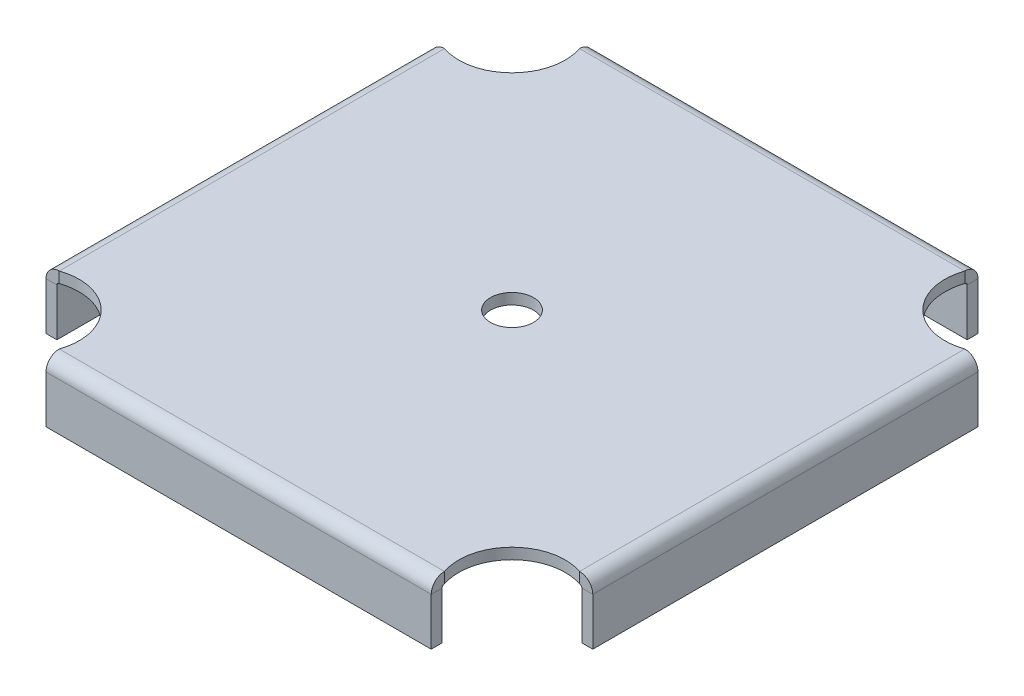
ISO-10303-21;
HEADER;
FILE_DESCRIPTION(('STEP AP214'),'2;1');
FILE_NAME('part.step','',(''),(''),'','','');
FILE_SCHEMA(('AUTOMOTIVE_DESIGN { 1 0 10303 214 1 1 1 1 }'));
ENDSEC;
DATA;
#1=APPLICATION_CONTEXT('core data for automotive mechanical design processes');
#2=APPLICATION_PROTOCOL_DEFINITION('international standard','automotive_design',2000,#1);
#3=PRODUCT_CONTEXT('',#1,'mechanical');
#4=PRODUCT('Part','Part','',(#3));
#5=PRODUCT_RELATED_PRODUCT_CATEGORY('part','',(#4));
#6=PRODUCT_DEFINITION_FORMATION('','',#4);
#7=PRODUCT_DEFINITION_CONTEXT('part definition',#1,'design');
#8=PRODUCT_DEFINITION('design','',#6,#7);
#9=PRODUCT_DEFINITION_SHAPE('','',#8);
#10=(LENGTH_UNIT() NAMED_UNIT(*) SI_UNIT(.MILLI.,.METRE.));
#11=(NAMED_UNIT(*) PLANE_ANGLE_UNIT() SI_UNIT($,.RADIAN.));
#12=(NAMED_UNIT(*) SI_UNIT($,.STERADIAN.) SOLID_ANGLE_UNIT());
#13=UNCERTAINTY_MEASURE_WITH_UNIT(LENGTH_MEASURE(1.E-05),#10,'distance_accuracy_value','');
#14=(GEOMETRIC_REPRESENTATION_CONTEXT(3) GLOBAL_UNCERTAINTY_ASSIGNED_CONTEXT((#13)) GLOBAL_UNIT_ASSIGNED_CONTEXT((#10,
#11,#12)) REPRESENTATION_CONTEXT('',''));
#15=CARTESIAN_POINT('',(0.,0.,0.));
#16=DIRECTION('',(0.,0.,1.));
#17=DIRECTION('',(1.,0.,0.));
#18=AXIS2_PLACEMENT_3D('',#15,#16,#17);
#19=CARTESIAN_POINT('',(76.2,-3.4163,76.2));
#20=DIRECTION('',(0.,1.,0.));
#21=DIRECTION('',(0.,0.,1.));
#22=AXIS2_PLACEMENT_3D('',#19,#20,#21);
#23=CYLINDRICAL_SURFACE('',#22,16.7005);
#24=CARTESIAN_POINT('',(76.2,0.,76.2));
#25=DIRECTION('',(0.,-1.,0.));
#26=DIRECTION('',(0.,0.,1.));
#27=AXIS2_PLACEMENT_3D('',#24,#25,#26);
#28=CIRCLE('',#27,16.7005);
#29=CARTESIAN_POINT('',(60.3828089759907,0.,81.5594));
#30=VERTEX_POINT('',#29);
#31=CARTESIAN_POINT('',(81.5594,0.,60.3828089759907));
#32=VERTEX_POINT('',#31);
#33=EDGE_CURVE('E467',#30,#32,#28,.T.);
#34=ORIENTED_EDGE('',*,*,#33,.F.);
#35=DIRECTION('',(0.,1.,0.));
#36=VECTOR('',#35,1.);
#37=CARTESIAN_POINT('',(60.3828089759907,-3.4163,81.5594));
#38=LINE('',#37,#36);
#39=CARTESIAN_POINT('',(60.3828089759907,-3.4163,81.5594));
#40=VERTEX_POINT('',#39);
#41=EDGE_CURVE('E13',#40,#30,#38,.T.);
#42=ORIENTED_EDGE('',*,*,#41,.F.);
#43=CARTESIAN_POINT('',(76.2,-3.4163,76.2));
#44=DIRECTION('',(0.,-1.,0.));
#45=DIRECTION('',(0.,0.,1.));
#46=AXIS2_PLACEMENT_3D('',#43,#44,#45);
#47=CIRCLE('',#46,16.7005);
#48=CARTESIAN_POINT('',(81.5594,-3.4163,60.3828089759907));
#49=VERTEX_POINT('',#48);
#50=EDGE_CURVE('E470',#40,#49,#47,.T.);
#51=ORIENTED_EDGE('',*,*,#50,.T.);
#52=DIRECTION('',(0.,1.,0.));
#53=VECTOR('',#52,1.);
#54=CARTESIAN_POINT('',(81.5594,-3.4163,60.3828089759907));
#55=LINE('',#54,#53);
#56=EDGE_CURVE('E124',#49,#32,#55,.T.);
#57=ORIENTED_EDGE('',*,*,#56,.T.);
#58=EDGE_LOOP('',(#34,#42,#51,#57));
#59=FACE_BOUND('',#58,.T.);
#60=ADVANCED_FACE('F121',(#59),#23,.F.);
#61=CARTESIAN_POINT('',(-76.2,-3.4163,76.2));
#62=DIRECTION('',(0.,1.,0.));
#63=DIRECTION('',(0.,0.,1.));
#64=AXIS2_PLACEMENT_3D('',#61,#62,#63);
#65=CYLINDRICAL_SURFACE('',#64,16.7005);
#66=CARTESIAN_POINT('',(-76.2,0.,76.2));
#67=DIRECTION('',(0.,-1.,0.));
#68=DIRECTION('',(0.,0.,1.));
#69=AXIS2_PLACEMENT_3D('',#66,#67,#68);
#70=CIRCLE('',#69,16.7005);
#71=CARTESIAN_POINT('',(-81.5594,0.,60.3828089759907));
#72=VERTEX_POINT('',#71);
#73=CARTESIAN_POINT('',(-60.3828089759907,0.,81.5594));
#74=VERTEX_POINT('',#73);
#75=EDGE_CURVE('E508',#72,#74,#70,.T.);
#76=ORIENTED_EDGE('',*,*,#75,.F.);
#77=DIRECTION('',(0.,1.,0.));
#78=VECTOR('',#77,1.);
#79=CARTESIAN_POINT('',(-81.5594,-3.4163,60.3828089759907));
#80=LINE('',#79,#78);
#81=CARTESIAN_POINT('',(-81.5594,-3.4163,60.3828089759907));
#82=VERTEX_POINT('',#81);
#83=EDGE_CURVE('E515',#82,#72,#80,.T.);
#84=ORIENTED_EDGE('',*,*,#83,.F.);
#85=CARTESIAN_POINT('',(-76.2,-3.4163,76.2));
#86=DIRECTION('',(0.,-1.,0.));
#87=DIRECTION('',(0.,0.,1.));
#88=AXIS2_PLACEMENT_3D('',#85,#86,#87);
#89=CIRCLE('',#88,16.7005);
#90=CARTESIAN_POINT('',(-60.3828089759907,-3.4163,81.5594));
#91=VERTEX_POINT('',#90);
#92=EDGE_CURVE('E486',#82,#91,#89,.T.);
#93=ORIENTED_EDGE('',*,*,#92,.T.);
#94=DIRECTION('',(0.,1.,0.));
#95=VECTOR('',#94,1.);
#96=CARTESIAN_POINT('',(-60.3828089759907,-3.4163,81.5594));
#97=LINE('',#96,#95);
#98=EDGE_CURVE('E129',#91,#74,#97,.T.);
#99=ORIENTED_EDGE('',*,*,#98,.T.);
#100=EDGE_LOOP('',(#76,#84,#93,#99));
#101=FACE_BOUND('',#100,.T.);
#102=ADVANCED_FACE('F547',(#101),#65,.F.);
#103=CARTESIAN_POINT('',(-76.2,-3.4163,-76.2));
#104=DIRECTION('',(0.,1.,0.));
#105=DIRECTION('',(0.,0.,1.));
#106=AXIS2_PLACEMENT_3D('',#103,#104,#105);
#107=CYLINDRICAL_SURFACE('',#106,16.7005);
#108=CARTESIAN_POINT('',(-76.2,0.,-76.2));
#109=DIRECTION('',(0.,-1.,0.));
#110=DIRECTION('',(0.,0.,1.));
#111=AXIS2_PLACEMENT_3D('',#108,#109,#110);
#112=CIRCLE('',#111,16.7005);
#113=CARTESIAN_POINT('',(-60.3828089759907,0.,-81.5594));
#114=VERTEX_POINT('',#113);
#115=CARTESIAN_POINT('',(-81.5594,0.,-60.3828089759907));
#116=VERTEX_POINT('',#115);
#117=EDGE_CURVE('E502',#114,#116,#112,.T.);
#118=ORIENTED_EDGE('',*,*,#117,.F.);
#119=DIRECTION('',(0.,1.,0.));
#120=VECTOR('',#119,1.);
#121=CARTESIAN_POINT('',(-60.3828089759907,-3.4163,-81.5594));
#122=LINE('',#121,#120);
#123=CARTESIAN_POINT('',(-60.3828089759907,-3.41630000000001,-81.5594));
#124=VERTEX_POINT('',#123);
#125=EDGE_CURVE('E520',#124,#114,#122,.T.);
#126=ORIENTED_EDGE('',*,*,#125,.F.);
#127=CARTESIAN_POINT('',(-76.2,-3.4163,-76.2));
#128=DIRECTION('',(0.,-1.,0.));
#129=DIRECTION('',(0.,0.,1.));
#130=AXIS2_PLACEMENT_3D('',#127,#128,#129);
#131=CIRCLE('',#130,16.7005);
#132=CARTESIAN_POINT('',(-81.5594,-3.4163,-60.3828089759907));
#133=VERTEX_POINT('',#132);
#134=EDGE_CURVE('E481',#124,#133,#131,.T.);
#135=ORIENTED_EDGE('',*,*,#134,.T.);
#136=DIRECTION('',(0.,1.,0.));
#137=VECTOR('',#136,1.);
#138=CARTESIAN_POINT('',(-81.5594,-3.4163,-60.3828089759907));
#139=LINE('',#138,#137);
#140=EDGE_CURVE('E517',#133,#116,#139,.T.);
#141=ORIENTED_EDGE('',*,*,#140,.T.);
#142=EDGE_LOOP('',(#118,#126,#135,#141));
#143=FACE_BOUND('',#142,.T.);
#144=ADVANCED_FACE('F593',(#143),#107,.F.);
#145=CARTESIAN_POINT('',(76.2,-3.4163,-76.2));
#146=DIRECTION('',(0.,1.,0.));
#147=DIRECTION('',(0.,0.,1.));
#148=AXIS2_PLACEMENT_3D('',#145,#146,#147);
#149=CYLINDRICAL_SURFACE('',#148,16.7005);
#150=CARTESIAN_POINT('',(76.2,0.,-76.2));
#151=DIRECTION('',(0.,-1.,0.));
#152=DIRECTION('',(0.,0.,1.));
#153=AXIS2_PLACEMENT_3D('',#150,#151,#152);
#154=CIRCLE('',#153,16.7005);
#155=CARTESIAN_POINT('',(81.5594,0.,-60.3828089759907));
#156=VERTEX_POINT('',#155);
#157=CARTESIAN_POINT('',(60.3828089759907,0.,-81.5594));
#158=VERTEX_POINT('',#157);
#159=EDGE_CURVE('E496',#156,#158,#154,.T.);
#160=ORIENTED_EDGE('',*,*,#159,.F.);
#161=DIRECTION('',(0.,1.,0.));
#162=VECTOR('',#161,1.);
#163=CARTESIAN_POINT('',(81.5594,-3.4163,-60.3828089759907));
#164=LINE('',#163,#162);
#165=CARTESIAN_POINT('',(81.5594,-3.4163,-60.3828089759907));
#166=VERTEX_POINT('',#165);
#167=EDGE_CURVE('E525',#166,#156,#164,.T.);
#168=ORIENTED_EDGE('',*,*,#167,.F.);
#169=CARTESIAN_POINT('',(76.2,-3.4163,-76.2));
#170=DIRECTION('',(0.,-1.,0.));
#171=DIRECTION('',(0.,0.,1.));
#172=AXIS2_PLACEMENT_3D('',#169,#170,#171);
#173=CIRCLE('',#172,16.7005);
#174=CARTESIAN_POINT('',(60.3828089759907,-3.41630000000001,-81.5594));
#175=VERTEX_POINT('',#174);
#176=EDGE_CURVE('E476',#166,#175,#173,.T.);
#177=ORIENTED_EDGE('',*,*,#176,.T.);
#178=DIRECTION('',(0.,1.,0.));
#179=VECTOR('',#178,1.);
#180=CARTESIAN_POINT('',(60.3828089759907,-3.4163,-81.5594));
#181=LINE('',#180,#179);
#182=EDGE_CURVE('E523',#175,#158,#181,.T.);
#183=ORIENTED_EDGE('',*,*,#182,.T.);
#184=EDGE_LOOP('',(#160,#168,#177,#183));
#185=FACE_BOUND('',#184,.T.);
#186=ADVANCED_FACE('F598',(#185),#149,.F.);
#187=CARTESIAN_POINT('',(76.2,-3.4163,76.2));
#188=DIRECTION('',(0.,1.,0.));
#189=DIRECTION('',(0.,0.,1.));
#190=AXIS2_PLACEMENT_3D('',#187,#188,#189);
#191=PLANE('',#190);
#192=CARTESIAN_POINT('',(0.,-3.4163,0.));
#193=DIRECTION('',(0.,1.,0.));
#194=DIRECTION('',(0.,0.,1.));
#195=AXIS2_PLACEMENT_3D('',#192,#193,#194);
#196=CIRCLE('',#195,6.7437);
#197=CARTESIAN_POINT('',(0.,-3.4163,6.7437));
#198=VERTEX_POINT('',#197);
#199=EDGE_CURVE('E464',#198,#198,#196,.T.);
#200=ORIENTED_EDGE('',*,*,#199,.T.);
#201=EDGE_LOOP('',(#200));
#202=FACE_BOUND('',#201,.T.);
#203=ORIENTED_EDGE('',*,*,#50,.F.);
#204=DIRECTION('',(1.,0.,0.));
#205=VECTOR('',#204,1.);
#206=CARTESIAN_POINT('',(60.3828089759907,-3.4163,81.5594));
#207=LINE('',#206,#205);
#208=EDGE_CURVE('E489',#91,#40,#207,.T.);
#209=ORIENTED_EDGE('',*,*,#208,.F.);
#210=ORIENTED_EDGE('',*,*,#92,.F.);
#211=DIRECTION('',(0.,0.,1.));
#212=VECTOR('',#211,1.);
#213=CARTESIAN_POINT('',(-81.5594,-3.4163,60.3828089759907));
#214=LINE('',#213,#212);
#215=EDGE_CURVE('E484',#133,#82,#214,.T.);
#216=ORIENTED_EDGE('',*,*,#215,.F.);
#217=ORIENTED_EDGE('',*,*,#134,.F.);
#218=DIRECTION('',(-1.,0.,0.));
#219=VECTOR('',#218,1.);
#220=CARTESIAN_POINT('',(-60.3828089759907,-3.4163,-81.5594));
#221=LINE('',#220,#219);
#222=EDGE_CURVE('E479',#175,#124,#221,.T.);
#223=ORIENTED_EDGE('',*,*,#222,.F.);
#224=ORIENTED_EDGE('',*,*,#176,.F.);
#225=DIRECTION('',(0.,0.,-1.));
#226=VECTOR('',#225,1.);
#227=CARTESIAN_POINT('',(81.5594,-3.4163,-60.3828089759907));
#228=LINE('',#227,#226);
#229=EDGE_CURVE('E473',#49,#166,#228,.T.);
#230=ORIENTED_EDGE('',*,*,#229,.F.);
#231=EDGE_LOOP('',(#203,#209,#210,#216,#217,#223,#224,#230));
#232=FACE_BOUND('',#231,.T.);
#233=ADVANCED_FACE('F553',(#202,#232),#191,.F.);
#234=CARTESIAN_POINT('',(76.2,0.,76.2));
#235=DIRECTION('',(0.,1.,0.));
#236=DIRECTION('',(0.,0.,1.));
#237=AXIS2_PLACEMENT_3D('',#234,#235,#236);
#238=PLANE('',#237);
#239=CARTESIAN_POINT('',(0.,0.,0.));
#240=DIRECTION('',(0.,1.,0.));
#241=DIRECTION('',(0.,0.,1.));
#242=AXIS2_PLACEMENT_3D('',#239,#240,#241);
#243=CIRCLE('',#242,6.7437);
#244=CARTESIAN_POINT('',(0.,0.,6.7437));
#245=VERTEX_POINT('',#244);
#246=EDGE_CURVE('E455',#245,#245,#243,.T.);
#247=ORIENTED_EDGE('',*,*,#246,.F.);
#248=EDGE_LOOP('',(#247));
#249=FACE_BOUND('',#248,.T.);
#250=ORIENTED_EDGE('',*,*,#33,.T.);
#251=DIRECTION('',(0.,0.,-1.));
#252=VECTOR('',#251,1.);
#253=CARTESIAN_POINT('',(81.5594,0.,-60.3828089759907));
#254=LINE('',#253,#252);
#255=EDGE_CURVE('E493',#32,#156,#254,.T.);
#256=ORIENTED_EDGE('',*,*,#255,.T.);
#257=ORIENTED_EDGE('',*,*,#159,.T.);
#258=DIRECTION('',(-1.,0.,0.));
#259=VECTOR('',#258,1.);
#260=CARTESIAN_POINT('',(-60.3828089759907,0.,-81.5594));
#261=LINE('',#260,#259);
#262=EDGE_CURVE('E499',#158,#114,#261,.T.);
#263=ORIENTED_EDGE('',*,*,#262,.T.);
#264=ORIENTED_EDGE('',*,*,#117,.T.);
#265=DIRECTION('',(0.,0.,1.));
#266=VECTOR('',#265,1.);
#267=CARTESIAN_POINT('',(-81.5594,0.,60.3828089759907));
#268=LINE('',#267,#266);
#269=EDGE_CURVE('E505',#116,#72,#268,.T.);
#270=ORIENTED_EDGE('',*,*,#269,.T.);
#271=ORIENTED_EDGE('',*,*,#75,.T.);
#272=DIRECTION('',(1.,0.,0.));
#273=VECTOR('',#272,1.);
#274=CARTESIAN_POINT('',(60.3828089759907,0.,81.5594));
#275=LINE('',#274,#273);
#276=EDGE_CURVE('E474',#74,#30,#275,.T.);
#277=ORIENTED_EDGE('',*,*,#276,.T.);
#278=EDGE_LOOP('',(#250,#256,#257,#263,#264,#270,#271,#277));
#279=FACE_BOUND('',#278,.T.);
#280=ADVANCED_FACE('F539',(#249,#279),#238,.T.);
#281=CARTESIAN_POINT('',(0.,-3.4163,0.));
#282=DIRECTION('',(0.,1.,0.));
#283=DIRECTION('',(0.,0.,1.));
#284=AXIS2_PLACEMENT_3D('',#281,#282,#283);
#285=CYLINDRICAL_SURFACE('',#284,6.7437);
#286=ORIENTED_EDGE('',*,*,#199,.F.);
#287=EDGE_LOOP('',(#286));
#288=FACE_BOUND('',#287,.T.);
#289=ORIENTED_EDGE('',*,*,#246,.T.);
#290=EDGE_LOOP('',(#289));
#291=FACE_BOUND('',#290,.T.);
#292=ADVANCED_FACE('F712',(#288,#291),#285,.F.);
#293=CARTESIAN_POINT('',(60.3828089759907,-4.1529,81.5594));
#294=DIRECTION('',(1.,0.,0.));
#295=DIRECTION('',(0.,0.,-1.));
#296=AXIS2_PLACEMENT_3D('',#293,#294,#295);
#297=PLANE('',#296);
#298=DIRECTION('',(0.,0.,1.));
#299=VECTOR('',#298,1.);
#300=CARTESIAN_POINT('',(60.3828089759907,-4.1529,85.7123));
#301=LINE('',#300,#299);
#302=CARTESIAN_POINT('',(60.3828089759907,-4.1529,82.296));
#303=VERTEX_POINT('',#302);
#304=CARTESIAN_POINT('',(60.3828089759907,-4.15289999999999,85.7123));
#305=VERTEX_POINT('',#304);
#306=EDGE_CURVE('E413',#303,#305,#301,.T.);
#307=ORIENTED_EDGE('',*,*,#306,.F.);
#308=CARTESIAN_POINT('',(60.3828089759907,-4.1529,81.5594));
#309=DIRECTION('',(-1.,0.,0.));
#310=DIRECTION('',(0.,0.,1.));
#311=AXIS2_PLACEMENT_3D('',#308,#309,#310);
#312=CIRCLE('',#311,0.736600000000004);
#313=EDGE_CURVE('E459',#40,#303,#312,.F.);
#314=ORIENTED_EDGE('',*,*,#313,.F.);
#315=ORIENTED_EDGE('',*,*,#41,.T.);
#316=CARTESIAN_POINT('',(60.3828089759907,-4.1529,81.5594));
#317=DIRECTION('',(-1.,0.,0.));
#318=DIRECTION('',(0.,0.,1.));
#319=AXIS2_PLACEMENT_3D('',#316,#317,#318);
#320=CIRCLE('',#319,4.1529);
#321=EDGE_CURVE('E137',#30,#305,#320,.F.);
#322=ORIENTED_EDGE('',*,*,#321,.T.);
#323=EDGE_LOOP('',(#307,#314,#315,#322));
#324=FACE_BOUND('',#323,.T.);
#325=ADVANCED_FACE('F560',(#324),#297,.T.);
#326=CARTESIAN_POINT('',(-60.3828089759907,-4.1529,81.5594));
#327=DIRECTION('',(1.,0.,0.));
#328=DIRECTION('',(0.,0.,-1.));
#329=AXIS2_PLACEMENT_3D('',#326,#327,#328);
#330=PLANE('',#329);
#331=CARTESIAN_POINT('',(-60.3828089759907,-4.1529,81.5594));
#332=DIRECTION('',(-1.,0.,0.));
#333=DIRECTION('',(0.,0.,1.));
#334=AXIS2_PLACEMENT_3D('',#331,#332,#333);
#335=CIRCLE('',#334,0.736600000000004);
#336=CARTESIAN_POINT('',(-60.3828089759907,-4.1529,82.296));
#337=VERTEX_POINT('',#336);
#338=EDGE_CURVE('E424',#337,#91,#335,.T.);
#339=ORIENTED_EDGE('',*,*,#338,.F.);
#340=DIRECTION('',(0.,0.,1.));
#341=VECTOR('',#340,1.);
#342=CARTESIAN_POINT('',(-60.3828089759907,-4.1529,82.296));
#343=LINE('',#342,#341);
#344=CARTESIAN_POINT('',(-60.3828089759907,-4.1529,85.7123));
#345=VERTEX_POINT('',#344);
#346=EDGE_CURVE('E447',#337,#345,#343,.T.);
#347=ORIENTED_EDGE('',*,*,#346,.T.);
#348=CARTESIAN_POINT('',(-60.3828089759907,-4.1529,81.5594));
#349=DIRECTION('',(-1.,0.,0.));
#350=DIRECTION('',(0.,0.,1.));
#351=AXIS2_PLACEMENT_3D('',#348,#349,#350);
#352=CIRCLE('',#351,4.1529);
#353=EDGE_CURVE('E456',#345,#74,#352,.T.);
#354=ORIENTED_EDGE('',*,*,#353,.T.);
#355=ORIENTED_EDGE('',*,*,#98,.F.);
#356=EDGE_LOOP('',(#339,#347,#354,#355));
#357=FACE_BOUND('',#356,.T.);
#358=ADVANCED_FACE('F544',(#357),#330,.F.);
#359=CARTESIAN_POINT('',(-60.3828089759907,-4.1529,81.5594));
#360=DIRECTION('',(-1.,0.,0.));
#361=DIRECTION('',(0.,0.,1.));
#362=AXIS2_PLACEMENT_3D('',#359,#360,#361);
#363=CYLINDRICAL_SURFACE('',#362,4.1529);
#364=ORIENTED_EDGE('',*,*,#276,.F.);
#365=ORIENTED_EDGE('',*,*,#353,.F.);
#366=DIRECTION('',(-1.,0.,0.));
#367=VECTOR('',#366,1.);
#368=CARTESIAN_POINT('',(0.,-4.1529,85.7123));
#369=LINE('',#368,#367);
#370=EDGE_CURVE('E444',#305,#345,#369,.T.);
#371=ORIENTED_EDGE('',*,*,#370,.F.);
#372=ORIENTED_EDGE('',*,*,#321,.F.);
#373=EDGE_LOOP('',(#364,#365,#371,#372));
#374=FACE_BOUND('',#373,.T.);
#375=ADVANCED_FACE('F541',(#374),#363,.T.);
#376=CARTESIAN_POINT('',(-60.3828089759907,-4.1529,81.5594));
#377=DIRECTION('',(-1.,0.,0.));
#378=DIRECTION('',(0.,0.,1.));
#379=AXIS2_PLACEMENT_3D('',#376,#377,#378);
#380=CYLINDRICAL_SURFACE('',#379,0.736600000000004);
#381=ORIENTED_EDGE('',*,*,#208,.T.);
#382=ORIENTED_EDGE('',*,*,#313,.T.);
#383=DIRECTION('',(1.,0.,0.));
#384=VECTOR('',#383,1.);
#385=CARTESIAN_POINT('',(60.3828089759907,-4.1529,82.296));
#386=LINE('',#385,#384);
#387=EDGE_CURVE('E450',#303,#337,#386,.F.);
#388=ORIENTED_EDGE('',*,*,#387,.T.);
#389=ORIENTED_EDGE('',*,*,#338,.T.);
#390=EDGE_LOOP('',(#381,#382,#388,#389));
#391=FACE_BOUND('',#390,.T.);
#392=ADVANCED_FACE('F557',(#391),#380,.F.);
#393=CARTESIAN_POINT('',(-60.3828089759907,-3.41629999999999,85.7123));
#394=DIRECTION('',(-1.,0.,0.));
#395=DIRECTION('',(0.,0.,1.));
#396=AXIS2_PLACEMENT_3D('',#393,#394,#395);
#397=PLANE('',#396);
#398=DIRECTION('',(0.,1.,0.));
#399=VECTOR('',#398,1.);
#400=CARTESIAN_POINT('',(-60.3828089759907,-3.41629999999999,85.7123));
#401=LINE('',#400,#399);
#402=CARTESIAN_POINT('',(-60.3828089759907,-19.05,85.7123));
#403=VERTEX_POINT('',#402);
#404=EDGE_CURVE('E428',#403,#345,#401,.T.);
#405=ORIENTED_EDGE('',*,*,#404,.T.);
#406=ORIENTED_EDGE('',*,*,#346,.F.);
#407=DIRECTION('',(0.,-1.,0.));
#408=VECTOR('',#407,1.);
#409=CARTESIAN_POINT('',(-60.3828089759907,2.17196961742773E-13,82.296));
#410=LINE('',#409,#408);
#411=CARTESIAN_POINT('',(-60.3828089759907,-19.05,82.296));
#412=VERTEX_POINT('',#411);
#413=EDGE_CURVE('E436',#412,#337,#410,.F.);
#414=ORIENTED_EDGE('',*,*,#413,.F.);
#415=DIRECTION('',(0.,0.,-1.));
#416=VECTOR('',#415,1.);
#417=CARTESIAN_POINT('',(-60.3828089759907,-19.05,85.7123));
#418=LINE('',#417,#416);
#419=EDGE_CURVE('E422',#403,#412,#418,.T.);
#420=ORIENTED_EDGE('',*,*,#419,.F.);
#421=EDGE_LOOP('',(#405,#406,#414,#420));
#422=FACE_BOUND('',#421,.T.);
#423=ADVANCED_FACE('F577',(#422),#397,.T.);
#424=CARTESIAN_POINT('',(60.3828089759907,-19.05,85.7123));
#425=DIRECTION('',(1.,0.,0.));
#426=DIRECTION('',(0.,0.,-1.));
#427=AXIS2_PLACEMENT_3D('',#424,#425,#426);
#428=PLANE('',#427);
#429=DIRECTION('',(0.,1.,0.));
#430=VECTOR('',#429,1.);
#431=CARTESIAN_POINT('',(60.3828089759907,2.17196961742773E-13,82.296));
#432=LINE('',#431,#430);
#433=CARTESIAN_POINT('',(60.3828089759907,-19.05,82.296));
#434=VERTEX_POINT('',#433);
#435=EDGE_CURVE('E442',#303,#434,#432,.F.);
#436=ORIENTED_EDGE('',*,*,#435,.F.);
#437=ORIENTED_EDGE('',*,*,#306,.T.);
#438=DIRECTION('',(0.,-1.,0.));
#439=VECTOR('',#438,1.);
#440=CARTESIAN_POINT('',(60.3828089759907,-19.05,85.7123));
#441=LINE('',#440,#439);
#442=CARTESIAN_POINT('',(60.3828089759907,-19.05,85.7123));
#443=VERTEX_POINT('',#442);
#444=EDGE_CURVE('E434',#305,#443,#441,.T.);
#445=ORIENTED_EDGE('',*,*,#444,.T.);
#446=DIRECTION('',(0.,0.,-1.));
#447=VECTOR('',#446,1.);
#448=CARTESIAN_POINT('',(60.3828089759907,-19.05,85.7123));
#449=LINE('',#448,#447);
#450=EDGE_CURVE('E425',#443,#434,#449,.T.);
#451=ORIENTED_EDGE('',*,*,#450,.T.);
#452=EDGE_LOOP('',(#436,#437,#445,#451));
#453=FACE_BOUND('',#452,.T.);
#454=ADVANCED_FACE('F564',(#453),#428,.T.);
#455=CARTESIAN_POINT('',(0.,2.29124909440663E-13,85.7123));
#456=DIRECTION('',(0.,0.,1.));
#457=DIRECTION('',(0.,-1.,0.));
#458=AXIS2_PLACEMENT_3D('',#455,#456,#457);
#459=PLANE('',#458);
#460=ORIENTED_EDGE('',*,*,#444,.F.);
#461=ORIENTED_EDGE('',*,*,#370,.T.);
#462=ORIENTED_EDGE('',*,*,#404,.F.);
#463=DIRECTION('',(-1.,0.,0.));
#464=VECTOR('',#463,1.);
#465=CARTESIAN_POINT('',(-60.3828089759907,-19.05,85.7123));
#466=LINE('',#465,#464);
#467=EDGE_CURVE('E431',#443,#403,#466,.T.);
#468=ORIENTED_EDGE('',*,*,#467,.F.);
#469=EDGE_LOOP('',(#460,#461,#462,#468));
#470=FACE_BOUND('',#469,.T.);
#471=ADVANCED_FACE('F568',(#470),#459,.T.);
#472=CARTESIAN_POINT('',(0.,2.17196961742773E-13,82.296));
#473=DIRECTION('',(0.,0.,1.));
#474=DIRECTION('',(0.,-1.,0.));
#475=AXIS2_PLACEMENT_3D('',#472,#473,#474);
#476=PLANE('',#475);
#477=ORIENTED_EDGE('',*,*,#387,.F.);
#478=ORIENTED_EDGE('',*,*,#435,.T.);
#479=DIRECTION('',(1.,0.,0.));
#480=VECTOR('',#479,1.);
#481=CARTESIAN_POINT('',(0.,-19.05,82.296));
#482=LINE('',#481,#480);
#483=EDGE_CURVE('E439',#434,#412,#482,.F.);
#484=ORIENTED_EDGE('',*,*,#483,.T.);
#485=ORIENTED_EDGE('',*,*,#413,.T.);
#486=EDGE_LOOP('',(#477,#478,#484,#485));
#487=FACE_BOUND('',#486,.T.);
#488=ADVANCED_FACE('F575',(#487),#476,.F.);
#489=CARTESIAN_POINT('',(-60.3828089759907,-19.05,85.7123));
#490=DIRECTION('',(0.,-1.,0.));
#491=DIRECTION('',(0.,0.,-1.));
#492=AXIS2_PLACEMENT_3D('',#489,#490,#491);
#493=PLANE('',#492);
#494=ORIENTED_EDGE('',*,*,#483,.F.);
#495=ORIENTED_EDGE('',*,*,#450,.F.);
#496=ORIENTED_EDGE('',*,*,#467,.T.);
#497=ORIENTED_EDGE('',*,*,#419,.T.);
#498=EDGE_LOOP('',(#494,#495,#496,#497));
#499=FACE_BOUND('',#498,.T.);
#500=ADVANCED_FACE('F572',(#499),#493,.T.);
#501=CARTESIAN_POINT('',(81.5594,-4.1529,-60.3828089759907));
#502=DIRECTION('',(0.,0.,-1.));
#503=DIRECTION('',(-1.,0.,0.));
#504=AXIS2_PLACEMENT_3D('',#501,#502,#503);
#505=PLANE('',#504);
#506=DIRECTION('',(1.,0.,0.));
#507=VECTOR('',#506,1.);
#508=CARTESIAN_POINT('',(85.7123,-4.15289999999999,-60.3828089759907));
#509=LINE('',#508,#507);
#510=CARTESIAN_POINT('',(82.296,-4.1529,-60.3828089759907));
#511=VERTEX_POINT('',#510);
#512=CARTESIAN_POINT('',(85.7123,-4.15289999999999,-60.3828089759907));
#513=VERTEX_POINT('',#512);
#514=EDGE_CURVE('E370',#511,#513,#509,.T.);
#515=ORIENTED_EDGE('',*,*,#514,.F.);
#516=CARTESIAN_POINT('',(81.5594,-4.1529,-60.3828089759907));
#517=DIRECTION('',(0.,0.,1.));
#518=DIRECTION('',(1.,0.,0.));
#519=AXIS2_PLACEMENT_3D('',#516,#517,#518);
#520=CIRCLE('',#519,0.736600000000004);
#521=EDGE_CURVE('E417',#166,#511,#520,.F.);
#522=ORIENTED_EDGE('',*,*,#521,.F.);
#523=ORIENTED_EDGE('',*,*,#167,.T.);
#524=CARTESIAN_POINT('',(81.5594,-4.1529,-60.3828089759907));
#525=DIRECTION('',(0.,0.,1.));
#526=DIRECTION('',(1.,0.,0.));
#527=AXIS2_PLACEMENT_3D('',#524,#525,#526);
#528=CIRCLE('',#527,4.1529);
#529=EDGE_CURVE('E410',#156,#513,#528,.F.);
#530=ORIENTED_EDGE('',*,*,#529,.T.);
#531=EDGE_LOOP('',(#515,#522,#523,#530));
#532=FACE_BOUND('',#531,.T.);
#533=ADVANCED_FACE('F695',(#532),#505,.T.);
#534=CARTESIAN_POINT('',(81.5594,-4.1529,60.3828089759907));
#535=DIRECTION('',(0.,0.,-1.));
#536=DIRECTION('',(-1.,0.,0.));
#537=AXIS2_PLACEMENT_3D('',#534,#535,#536);
#538=PLANE('',#537);
#539=CARTESIAN_POINT('',(81.5594,-4.1529,60.3828089759907));
#540=DIRECTION('',(0.,0.,1.));
#541=DIRECTION('',(1.,0.,0.));
#542=AXIS2_PLACEMENT_3D('',#539,#540,#541);
#543=CIRCLE('',#542,0.736600000000004);
#544=CARTESIAN_POINT('',(82.296,-4.1529,60.3828089759907));
#545=VERTEX_POINT('',#544);
#546=EDGE_CURVE('E381',#545,#49,#543,.T.);
#547=ORIENTED_EDGE('',*,*,#546,.F.);
#548=DIRECTION('',(1.,0.,0.));
#549=VECTOR('',#548,1.);
#550=CARTESIAN_POINT('',(82.296,-4.1529,60.3828089759907));
#551=LINE('',#550,#549);
#552=CARTESIAN_POINT('',(85.7123,-4.15289999999999,60.3828089759907));
#553=VERTEX_POINT('',#552);
#554=EDGE_CURVE('E403',#545,#553,#551,.T.);
#555=ORIENTED_EDGE('',*,*,#554,.T.);
#556=CARTESIAN_POINT('',(81.5594,-4.1529,60.3828089759907));
#557=DIRECTION('',(0.,0.,1.));
#558=DIRECTION('',(1.,0.,0.));
#559=AXIS2_PLACEMENT_3D('',#556,#557,#558);
#560=CIRCLE('',#559,4.1529);
#561=EDGE_CURVE('E414',#553,#32,#560,.T.);
#562=ORIENTED_EDGE('',*,*,#561,.T.);
#563=ORIENTED_EDGE('',*,*,#56,.F.);
#564=EDGE_LOOP('',(#547,#555,#562,#563));
#565=FACE_BOUND('',#564,.T.);
#566=ADVANCED_FACE('F690',(#565),#538,.F.);
#567=CARTESIAN_POINT('',(81.5594,-4.1529,60.3828089759907));
#568=DIRECTION('',(0.,0.,1.));
#569=DIRECTION('',(1.,0.,0.));
#570=AXIS2_PLACEMENT_3D('',#567,#568,#569);
#571=CYLINDRICAL_SURFACE('',#570,4.1529);
#572=ORIENTED_EDGE('',*,*,#255,.F.);
#573=ORIENTED_EDGE('',*,*,#561,.F.);
#574=DIRECTION('',(0.,0.,1.));
#575=VECTOR('',#574,1.);
#576=CARTESIAN_POINT('',(85.7123,-4.15289999999999,-60.3828089759907));
#577=LINE('',#576,#575);
#578=EDGE_CURVE('E401',#553,#513,#577,.F.);
#579=ORIENTED_EDGE('',*,*,#578,.T.);
#580=ORIENTED_EDGE('',*,*,#529,.F.);
#581=EDGE_LOOP('',(#572,#573,#579,#580));
#582=FACE_BOUND('',#581,.T.);
#583=ADVANCED_FACE('F687',(#582),#571,.T.);
#584=CARTESIAN_POINT('',(81.5594,-4.1529,60.3828089759907));
#585=DIRECTION('',(0.,0.,1.));
#586=DIRECTION('',(1.,0.,0.));
#587=AXIS2_PLACEMENT_3D('',#584,#585,#586);
#588=CYLINDRICAL_SURFACE('',#587,0.736600000000004);
#589=ORIENTED_EDGE('',*,*,#229,.T.);
#590=ORIENTED_EDGE('',*,*,#521,.T.);
#591=DIRECTION('',(0.,0.,1.));
#592=VECTOR('',#591,1.);
#593=CARTESIAN_POINT('',(82.296,-4.1529,-60.3828089759907));
#594=LINE('',#593,#592);
#595=EDGE_CURVE('E406',#511,#545,#594,.T.);
#596=ORIENTED_EDGE('',*,*,#595,.T.);
#597=ORIENTED_EDGE('',*,*,#546,.T.);
#598=EDGE_LOOP('',(#589,#590,#596,#597));
#599=FACE_BOUND('',#598,.T.);
#600=ADVANCED_FACE('F685',(#599),#588,.F.);
#601=CARTESIAN_POINT('',(85.7123,-3.41629999999999,-60.3828089759907));
#602=DIRECTION('',(0.,0.,-1.));
#603=DIRECTION('',(-1.,0.,0.));
#604=AXIS2_PLACEMENT_3D('',#601,#602,#603);
#605=PLANE('',#604);
#606=DIRECTION('',(0.,-1.,0.));
#607=VECTOR('',#606,1.);
#608=CARTESIAN_POINT('',(82.296,2.89595948990364E-13,-60.3828089759907));
#609=LINE('',#608,#607);
#610=CARTESIAN_POINT('',(82.2960000000001,-19.05,-60.3828089759907));
#611=VERTEX_POINT('',#610);
#612=EDGE_CURVE('E399',#511,#611,#609,.T.);
#613=ORIENTED_EDGE('',*,*,#612,.F.);
#614=ORIENTED_EDGE('',*,*,#514,.T.);
#615=DIRECTION('',(0.,1.,0.));
#616=VECTOR('',#615,1.);
#617=CARTESIAN_POINT('',(85.7123,-3.41629999999999,-60.3828089759907));
#618=LINE('',#617,#616);
#619=CARTESIAN_POINT('',(85.7123000000001,-19.05,-60.3828089759907));
#620=VERTEX_POINT('',#619);
#621=EDGE_CURVE('E391',#513,#620,#618,.F.);
#622=ORIENTED_EDGE('',*,*,#621,.T.);
#623=DIRECTION('',(-1.,0.,0.));
#624=VECTOR('',#623,1.);
#625=CARTESIAN_POINT('',(85.7123000000001,-19.05,-60.3828089759907));
#626=LINE('',#625,#624);
#627=EDGE_CURVE('E382',#620,#611,#626,.T.);
#628=ORIENTED_EDGE('',*,*,#627,.T.);
#629=EDGE_LOOP('',(#613,#614,#622,#628));
#630=FACE_BOUND('',#629,.T.);
#631=ADVANCED_FACE('F678',(#630),#605,.T.);
#632=CARTESIAN_POINT('',(85.7123000000001,-19.05,60.3828089759907));
#633=DIRECTION('',(0.,0.,1.));
#634=DIRECTION('',(0.,-1.,0.));
#635=AXIS2_PLACEMENT_3D('',#632,#633,#634);
#636=PLANE('',#635);
#637=DIRECTION('',(0.,-1.,0.));
#638=VECTOR('',#637,1.);
#639=CARTESIAN_POINT('',(85.7123000000001,-19.05,60.3828089759907));
#640=LINE('',#639,#638);
#641=CARTESIAN_POINT('',(85.7123000000001,-19.05,60.3828089759907));
#642=VERTEX_POINT('',#641);
#643=EDGE_CURVE('E385',#642,#553,#640,.F.);
#644=ORIENTED_EDGE('',*,*,#643,.T.);
#645=ORIENTED_EDGE('',*,*,#554,.F.);
#646=DIRECTION('',(0.,1.,0.));
#647=VECTOR('',#646,1.);
#648=CARTESIAN_POINT('',(82.296,3.16396380436809E-13,60.3828089759907));
#649=LINE('',#648,#647);
#650=CARTESIAN_POINT('',(82.2960000000001,-19.05,60.3828089759907));
#651=VERTEX_POINT('',#650);
#652=EDGE_CURVE('E393',#651,#545,#649,.T.);
#653=ORIENTED_EDGE('',*,*,#652,.F.);
#654=DIRECTION('',(-1.,0.,0.));
#655=VECTOR('',#654,1.);
#656=CARTESIAN_POINT('',(85.7123000000001,-19.05,60.3828089759907));
#657=LINE('',#656,#655);
#658=EDGE_CURVE('E379',#642,#651,#657,.T.);
#659=ORIENTED_EDGE('',*,*,#658,.F.);
#660=EDGE_LOOP('',(#644,#645,#653,#659));
#661=FACE_BOUND('',#660,.T.);
#662=ADVANCED_FACE('F671',(#661),#636,.T.);
#663=CARTESIAN_POINT('',(85.7123,3.01523896688254E-13,0.));
#664=DIRECTION('',(-1.,0.,0.));
#665=DIRECTION('',(0.,-1.,0.));
#666=AXIS2_PLACEMENT_3D('',#663,#664,#665);
#667=PLANE('',#666);
#668=ORIENTED_EDGE('',*,*,#578,.F.);
#669=ORIENTED_EDGE('',*,*,#643,.F.);
#670=DIRECTION('',(0.,0.,-1.));
#671=VECTOR('',#670,1.);
#672=CARTESIAN_POINT('',(85.7123000000001,-19.05,-60.3828089759907));
#673=LINE('',#672,#671);
#674=EDGE_CURVE('E388',#620,#642,#673,.F.);
#675=ORIENTED_EDGE('',*,*,#674,.F.);
#676=ORIENTED_EDGE('',*,*,#621,.F.);
#677=EDGE_LOOP('',(#668,#669,#675,#676));
#678=FACE_BOUND('',#677,.T.);
#679=ADVANCED_FACE('F667',(#678),#667,.F.);
#680=CARTESIAN_POINT('',(82.296,2.89595948990364E-13,0.));
#681=DIRECTION('',(-1.,0.,0.));
#682=DIRECTION('',(0.,-1.,0.));
#683=AXIS2_PLACEMENT_3D('',#680,#681,#682);
#684=PLANE('',#683);
#685=ORIENTED_EDGE('',*,*,#652,.T.);
#686=ORIENTED_EDGE('',*,*,#595,.F.);
#687=ORIENTED_EDGE('',*,*,#612,.T.);
#688=DIRECTION('',(0.,0.,1.));
#689=VECTOR('',#688,1.);
#690=CARTESIAN_POINT('',(82.2960000000001,-19.05,0.));
#691=LINE('',#690,#689);
#692=EDGE_CURVE('E396',#611,#651,#691,.T.);
#693=ORIENTED_EDGE('',*,*,#692,.T.);
#694=EDGE_LOOP('',(#685,#686,#687,#693));
#695=FACE_BOUND('',#694,.T.);
#696=ADVANCED_FACE('F670',(#695),#684,.T.);
#697=CARTESIAN_POINT('',(85.7123000000001,-19.05,-60.3828089759907));
#698=DIRECTION('',(0.,-1.,0.));
#699=DIRECTION('',(1.,0.,0.));
#700=AXIS2_PLACEMENT_3D('',#697,#698,#699);
#701=PLANE('',#700);
#702=ORIENTED_EDGE('',*,*,#692,.F.);
#703=ORIENTED_EDGE('',*,*,#627,.F.);
#704=ORIENTED_EDGE('',*,*,#674,.T.);
#705=ORIENTED_EDGE('',*,*,#658,.T.);
#706=EDGE_LOOP('',(#702,#703,#704,#705));
#707=FACE_BOUND('',#706,.T.);
#708=ADVANCED_FACE('F664',(#707),#701,.T.);
#709=CARTESIAN_POINT('',(-60.3828089759907,-4.15290000000001,-81.5594));
#710=DIRECTION('',(-1.,0.,0.));
#711=DIRECTION('',(0.,0.,1.));
#712=AXIS2_PLACEMENT_3D('',#709,#710,#711);
#713=PLANE('',#712);
#714=DIRECTION('',(0.,0.,-1.));
#715=VECTOR('',#714,1.);
#716=CARTESIAN_POINT('',(-60.3828089759907,-4.15289999999998,-85.7123));
#717=LINE('',#716,#715);
#718=CARTESIAN_POINT('',(-60.3828089759907,-4.15290000000001,-82.296));
#719=VERTEX_POINT('',#718);
#720=CARTESIAN_POINT('',(-60.3828089759907,-4.1529,-85.7123));
#721=VERTEX_POINT('',#720);
#722=EDGE_CURVE('E327',#719,#721,#717,.T.);
#723=ORIENTED_EDGE('',*,*,#722,.F.);
#724=CARTESIAN_POINT('',(-60.3828089759907,-4.15290000000001,-81.5594));
#725=DIRECTION('',(1.,0.,0.));
#726=DIRECTION('',(0.,0.,-1.));
#727=AXIS2_PLACEMENT_3D('',#724,#725,#726);
#728=CIRCLE('',#727,0.736600000000004);
#729=EDGE_CURVE('E374',#124,#719,#728,.F.);
#730=ORIENTED_EDGE('',*,*,#729,.F.);
#731=ORIENTED_EDGE('',*,*,#125,.T.);
#732=CARTESIAN_POINT('',(-60.3828089759907,-4.15290000000001,-81.5594));
#733=DIRECTION('',(1.,0.,0.));
#734=DIRECTION('',(0.,0.,-1.));
#735=AXIS2_PLACEMENT_3D('',#732,#733,#734);
#736=CIRCLE('',#735,4.1529);
#737=EDGE_CURVE('E367',#114,#721,#736,.F.);
#738=ORIENTED_EDGE('',*,*,#737,.T.);
#739=EDGE_LOOP('',(#723,#730,#731,#738));
#740=FACE_BOUND('',#739,.T.);
#741=ADVANCED_FACE('F635',(#740),#713,.T.);
#742=CARTESIAN_POINT('',(60.3828089759907,-4.15290000000001,-81.5594));
#743=DIRECTION('',(-1.,0.,0.));
#744=DIRECTION('',(0.,0.,1.));
#745=AXIS2_PLACEMENT_3D('',#742,#743,#744);
#746=PLANE('',#745);
#747=CARTESIAN_POINT('',(60.3828089759907,-4.15290000000001,-81.5594));
#748=DIRECTION('',(1.,0.,0.));
#749=DIRECTION('',(0.,0.,-1.));
#750=AXIS2_PLACEMENT_3D('',#747,#748,#749);
#751=CIRCLE('',#750,0.736600000000004);
#752=CARTESIAN_POINT('',(60.3828089759907,-4.15290000000001,-82.296));
#753=VERTEX_POINT('',#752);
#754=EDGE_CURVE('E338',#753,#175,#751,.T.);
#755=ORIENTED_EDGE('',*,*,#754,.F.);
#756=DIRECTION('',(0.,0.,-1.));
#757=VECTOR('',#756,1.);
#758=CARTESIAN_POINT('',(60.3828089759907,-4.15290000000001,-82.296));
#759=LINE('',#758,#757);
#760=CARTESIAN_POINT('',(60.3828089759907,-4.15289999999999,-85.7123));
#761=VERTEX_POINT('',#760);
#762=EDGE_CURVE('E360',#753,#761,#759,.T.);
#763=ORIENTED_EDGE('',*,*,#762,.T.);
#764=CARTESIAN_POINT('',(60.3828089759907,-4.15290000000001,-81.5594));
#765=DIRECTION('',(1.,0.,0.));
#766=DIRECTION('',(0.,0.,-1.));
#767=AXIS2_PLACEMENT_3D('',#764,#765,#766);
#768=CIRCLE('',#767,4.1529);
#769=EDGE_CURVE('E371',#761,#158,#768,.T.);
#770=ORIENTED_EDGE('',*,*,#769,.T.);
#771=ORIENTED_EDGE('',*,*,#182,.F.);
#772=EDGE_LOOP('',(#755,#763,#770,#771));
#773=FACE_BOUND('',#772,.T.);
#774=ADVANCED_FACE('F615',(#773),#746,.F.);
#775=CARTESIAN_POINT('',(60.3828089759907,-4.15290000000001,-81.5594));
#776=DIRECTION('',(1.,0.,0.));
#777=DIRECTION('',(0.,0.,-1.));
#778=AXIS2_PLACEMENT_3D('',#775,#776,#777);
#779=CYLINDRICAL_SURFACE('',#778,4.1529);
#780=ORIENTED_EDGE('',*,*,#262,.F.);
#781=ORIENTED_EDGE('',*,*,#769,.F.);
#782=DIRECTION('',(1.,0.,0.));
#783=VECTOR('',#782,1.);
#784=CARTESIAN_POINT('',(-60.3828089759907,-4.15289999999998,-85.7123));
#785=LINE('',#784,#783);
#786=EDGE_CURVE('E358',#761,#721,#785,.F.);
#787=ORIENTED_EDGE('',*,*,#786,.T.);
#788=ORIENTED_EDGE('',*,*,#737,.F.);
#789=EDGE_LOOP('',(#780,#781,#787,#788));
#790=FACE_BOUND('',#789,.T.);
#791=ADVANCED_FACE('F612',(#790),#779,.T.);
#792=CARTESIAN_POINT('',(60.3828089759907,-4.15290000000001,-81.5594));
#793=DIRECTION('',(1.,0.,0.));
#794=DIRECTION('',(0.,0.,-1.));
#795=AXIS2_PLACEMENT_3D('',#792,#793,#794);
#796=CYLINDRICAL_SURFACE('',#795,0.736600000000004);
#797=ORIENTED_EDGE('',*,*,#222,.T.);
#798=ORIENTED_EDGE('',*,*,#729,.T.);
#799=DIRECTION('',(1.,0.,0.));
#800=VECTOR('',#799,1.);
#801=CARTESIAN_POINT('',(-60.3828089759907,-4.1529,-82.296));
#802=LINE('',#801,#800);
#803=EDGE_CURVE('E363',#719,#753,#802,.T.);
#804=ORIENTED_EDGE('',*,*,#803,.T.);
#805=ORIENTED_EDGE('',*,*,#754,.T.);
#806=EDGE_LOOP('',(#797,#798,#804,#805));
#807=FACE_BOUND('',#806,.T.);
#808=ADVANCED_FACE('F639',(#807),#796,.F.);
#809=CARTESIAN_POINT('',(-60.3828089759907,-3.41629999999999,-85.7123));
#810=DIRECTION('',(-1.,0.,0.));
#811=DIRECTION('',(0.,0.,1.));
#812=AXIS2_PLACEMENT_3D('',#809,#810,#811);
#813=PLANE('',#812);
#814=DIRECTION('',(0.,-1.,0.));
#815=VECTOR('',#814,1.);
#816=CARTESIAN_POINT('',(-60.3828089759907,2.89595948990364E-13,-82.296));
#817=LINE('',#816,#815);
#818=CARTESIAN_POINT('',(-60.3828089759907,-19.05,-82.296));
#819=VERTEX_POINT('',#818);
#820=EDGE_CURVE('E356',#719,#819,#817,.T.);
#821=ORIENTED_EDGE('',*,*,#820,.F.);
#822=ORIENTED_EDGE('',*,*,#722,.T.);
#823=DIRECTION('',(0.,1.,0.));
#824=VECTOR('',#823,1.);
#825=CARTESIAN_POINT('',(-60.3828089759907,-3.41629999999999,-85.7123));
#826=LINE('',#825,#824);
#827=CARTESIAN_POINT('',(-60.3828089759907,-19.05,-85.7123));
#828=VERTEX_POINT('',#827);
#829=EDGE_CURVE('E348',#721,#828,#826,.F.);
#830=ORIENTED_EDGE('',*,*,#829,.T.);
#831=DIRECTION('',(0.,0.,1.));
#832=VECTOR('',#831,1.);
#833=CARTESIAN_POINT('',(-60.3828089759907,-19.05,-85.7123));
#834=LINE('',#833,#832);
#835=EDGE_CURVE('E339',#828,#819,#834,.T.);
#836=ORIENTED_EDGE('',*,*,#835,.T.);
#837=EDGE_LOOP('',(#821,#822,#830,#836));
#838=FACE_BOUND('',#837,.T.);
#839=ADVANCED_FACE('F632',(#838),#813,.T.);
#840=CARTESIAN_POINT('',(60.3828089759907,-19.05,-85.7123));
#841=DIRECTION('',(1.,0.,0.));
#842=DIRECTION('',(0.,1.,0.));
#843=AXIS2_PLACEMENT_3D('',#840,#841,#842);
#844=PLANE('',#843);
#845=DIRECTION('',(0.,-1.,0.));
#846=VECTOR('',#845,1.);
#847=CARTESIAN_POINT('',(60.3828089759907,-19.05,-85.7123));
#848=LINE('',#847,#846);
#849=CARTESIAN_POINT('',(60.3828089759907,-19.05,-85.7123));
#850=VERTEX_POINT('',#849);
#851=EDGE_CURVE('E342',#850,#761,#848,.F.);
#852=ORIENTED_EDGE('',*,*,#851,.T.);
#853=ORIENTED_EDGE('',*,*,#762,.F.);
#854=DIRECTION('',(0.,1.,0.));
#855=VECTOR('',#854,1.);
#856=CARTESIAN_POINT('',(60.3828089759907,3.16396380436809E-13,-82.2959999999999));
#857=LINE('',#856,#855);
#858=CARTESIAN_POINT('',(60.3828089759907,-19.05,-82.296));
#859=VERTEX_POINT('',#858);
#860=EDGE_CURVE('E350',#859,#753,#857,.T.);
#861=ORIENTED_EDGE('',*,*,#860,.F.);
#862=DIRECTION('',(0.,0.,1.));
#863=VECTOR('',#862,1.);
#864=CARTESIAN_POINT('',(60.3828089759907,-19.05,-85.7123));
#865=LINE('',#864,#863);
#866=EDGE_CURVE('E336',#850,#859,#865,.T.);
#867=ORIENTED_EDGE('',*,*,#866,.F.);
#868=EDGE_LOOP('',(#852,#853,#861,#867));
#869=FACE_BOUND('',#868,.T.);
#870=ADVANCED_FACE('F625',(#869),#844,.T.);
#871=CARTESIAN_POINT('',(0.,3.01523896688253E-13,-85.7123));
#872=DIRECTION('',(0.,0.,1.));
#873=DIRECTION('',(0.,-1.,0.));
#874=AXIS2_PLACEMENT_3D('',#871,#872,#873);
#875=PLANE('',#874);
#876=ORIENTED_EDGE('',*,*,#786,.F.);
#877=ORIENTED_EDGE('',*,*,#851,.F.);
#878=DIRECTION('',(-1.,0.,0.));
#879=VECTOR('',#878,1.);
#880=CARTESIAN_POINT('',(-60.3828089759907,-19.05,-85.7123));
#881=LINE('',#880,#879);
#882=EDGE_CURVE('E345',#828,#850,#881,.F.);
#883=ORIENTED_EDGE('',*,*,#882,.F.);
#884=ORIENTED_EDGE('',*,*,#829,.F.);
#885=EDGE_LOOP('',(#876,#877,#883,#884));
#886=FACE_BOUND('',#885,.T.);
#887=ADVANCED_FACE('F623',(#886),#875,.F.);
#888=CARTESIAN_POINT('',(0.,2.89595948990364E-13,-82.296));
#889=DIRECTION('',(0.,0.,1.));
#890=DIRECTION('',(0.,-1.,0.));
#891=AXIS2_PLACEMENT_3D('',#888,#889,#890);
#892=PLANE('',#891);
#893=ORIENTED_EDGE('',*,*,#860,.T.);
#894=ORIENTED_EDGE('',*,*,#803,.F.);
#895=ORIENTED_EDGE('',*,*,#820,.T.);
#896=DIRECTION('',(1.,0.,0.));
#897=VECTOR('',#896,1.);
#898=CARTESIAN_POINT('',(0.,-19.05,-82.296));
#899=LINE('',#898,#897);
#900=EDGE_CURVE('E353',#819,#859,#899,.T.);
#901=ORIENTED_EDGE('',*,*,#900,.T.);
#902=EDGE_LOOP('',(#893,#894,#895,#901));
#903=FACE_BOUND('',#902,.T.);
#904=ADVANCED_FACE('F642',(#903),#892,.T.);
#905=CARTESIAN_POINT('',(-60.3828089759907,-19.05,-85.7123));
#906=DIRECTION('',(0.,-1.,0.));
#907=DIRECTION('',(0.,0.,-1.));
#908=AXIS2_PLACEMENT_3D('',#905,#906,#907);
#909=PLANE('',#908);
#910=ORIENTED_EDGE('',*,*,#900,.F.);
#911=ORIENTED_EDGE('',*,*,#835,.F.);
#912=ORIENTED_EDGE('',*,*,#882,.T.);
#913=ORIENTED_EDGE('',*,*,#866,.T.);
#914=EDGE_LOOP('',(#910,#911,#912,#913));
#915=FACE_BOUND('',#914,.T.);
#916=ADVANCED_FACE('F628',(#915),#909,.T.);
#917=CARTESIAN_POINT('',(-81.5594,-4.1529,60.3828089759907));
#918=DIRECTION('',(0.,0.,1.));
#919=DIRECTION('',(1.,0.,0.));
#920=AXIS2_PLACEMENT_3D('',#917,#918,#919);
#921=PLANE('',#920);
#922=DIRECTION('',(-1.,0.,0.));
#923=VECTOR('',#922,1.);
#924=CARTESIAN_POINT('',(-85.7123,-4.15289999999999,60.3828089759907));
#925=LINE('',#924,#923);
#926=CARTESIAN_POINT('',(-82.296,-4.1529,60.3828089759907));
#927=VERTEX_POINT('',#926);
#928=CARTESIAN_POINT('',(-85.7123,-4.15289999999999,60.3828089759907));
#929=VERTEX_POINT('',#928);
#930=EDGE_CURVE('E323',#927,#929,#925,.T.);
#931=ORIENTED_EDGE('',*,*,#930,.F.);
#932=CARTESIAN_POINT('',(-81.5594,-4.1529,60.3828089759907));
#933=DIRECTION('',(0.,0.,-1.));
#934=DIRECTION('',(-1.,0.,0.));
#935=AXIS2_PLACEMENT_3D('',#932,#933,#934);
#936=CIRCLE('',#935,0.736600000000004);
#937=EDGE_CURVE('E331',#82,#927,#936,.F.);
#938=ORIENTED_EDGE('',*,*,#937,.F.);
#939=ORIENTED_EDGE('',*,*,#83,.T.);
#940=CARTESIAN_POINT('',(-81.5594,-4.1529,60.3828089759907));
#941=DIRECTION('',(0.,0.,-1.));
#942=DIRECTION('',(-1.,0.,0.));
#943=AXIS2_PLACEMENT_3D('',#940,#941,#942);
#944=CIRCLE('',#943,4.1529);
#945=EDGE_CURVE('E144',#72,#929,#944,.F.);
#946=ORIENTED_EDGE('',*,*,#945,.T.);
#947=EDGE_LOOP('',(#931,#938,#939,#946));
#948=FACE_BOUND('',#947,.T.);
#949=ADVANCED_FACE('F649',(#948),#921,.T.);
#950=CARTESIAN_POINT('',(-81.5594,-4.1529,-60.3828089759907));
#951=DIRECTION('',(0.,0.,1.));
#952=DIRECTION('',(1.,0.,0.));
#953=AXIS2_PLACEMENT_3D('',#950,#951,#952);
#954=PLANE('',#953);
#955=CARTESIAN_POINT('',(-81.5594,-4.1529,-60.3828089759907));
#956=DIRECTION('',(0.,0.,-1.));
#957=DIRECTION('',(-1.,0.,0.));
#958=AXIS2_PLACEMENT_3D('',#955,#956,#957);
#959=CIRCLE('',#958,0.736600000000004);
#960=CARTESIAN_POINT('',(-82.296,-4.1529,-60.3828089759907));
#961=VERTEX_POINT('',#960);
#962=EDGE_CURVE('E293',#961,#133,#959,.T.);
#963=ORIENTED_EDGE('',*,*,#962,.F.);
#964=DIRECTION('',(-1.,0.,0.));
#965=VECTOR('',#964,1.);
#966=CARTESIAN_POINT('',(-82.296,-4.1529,-60.3828089759907));
#967=LINE('',#966,#965);
#968=CARTESIAN_POINT('',(-85.7123,-4.15289999999999,-60.3828089759907));
#969=VERTEX_POINT('',#968);
#970=EDGE_CURVE('E318',#961,#969,#967,.T.);
#971=ORIENTED_EDGE('',*,*,#970,.T.);
#972=CARTESIAN_POINT('',(-81.5594,-4.1529,-60.3828089759907));
#973=DIRECTION('',(0.,0.,-1.));
#974=DIRECTION('',(-1.,0.,0.));
#975=AXIS2_PLACEMENT_3D('',#972,#973,#974);
#976=CIRCLE('',#975,4.1529);
#977=EDGE_CURVE('E328',#969,#116,#976,.T.);
#978=ORIENTED_EDGE('',*,*,#977,.T.);
#979=ORIENTED_EDGE('',*,*,#140,.F.);
#980=EDGE_LOOP('',(#963,#971,#978,#979));
#981=FACE_BOUND('',#980,.T.);
#982=ADVANCED_FACE('F887',(#981),#954,.F.);
#983=CARTESIAN_POINT('',(-81.5594,-4.1529,-60.3828089759907));
#984=DIRECTION('',(0.,0.,-1.));
#985=DIRECTION('',(-1.,0.,0.));
#986=AXIS2_PLACEMENT_3D('',#983,#984,#985);
#987=CYLINDRICAL_SURFACE('',#986,4.1529);
#988=ORIENTED_EDGE('',*,*,#269,.F.);
#989=ORIENTED_EDGE('',*,*,#977,.F.);
#990=DIRECTION('',(0.,0.,-1.));
#991=VECTOR('',#990,1.);
#992=CARTESIAN_POINT('',(-85.7123,-4.15289999999999,60.3828089759907));
#993=LINE('',#992,#991);
#994=EDGE_CURVE('E302',#969,#929,#993,.F.);
#995=ORIENTED_EDGE('',*,*,#994,.T.);
#996=ORIENTED_EDGE('',*,*,#945,.F.);
#997=EDGE_LOOP('',(#988,#989,#995,#996));
#998=FACE_BOUND('',#997,.T.);
#999=ADVANCED_FACE('F897',(#998),#987,.T.);
#1000=CARTESIAN_POINT('',(-81.5594,-4.1529,-60.3828089759907));
#1001=DIRECTION('',(0.,0.,-1.));
#1002=DIRECTION('',(-1.,0.,0.));
#1003=AXIS2_PLACEMENT_3D('',#1000,#1001,#1002);
#1004=CYLINDRICAL_SURFACE('',#1003,0.736600000000004);
#1005=ORIENTED_EDGE('',*,*,#215,.T.);
#1006=ORIENTED_EDGE('',*,*,#937,.T.);
#1007=DIRECTION('',(0.,0.,-1.));
#1008=VECTOR('',#1007,1.);
#1009=CARTESIAN_POINT('',(-82.296,-4.1529,60.3828089759907));
#1010=LINE('',#1009,#1008);
#1011=EDGE_CURVE('E321',#927,#961,#1010,.T.);
#1012=ORIENTED_EDGE('',*,*,#1011,.T.);
#1013=ORIENTED_EDGE('',*,*,#962,.T.);
#1014=EDGE_LOOP('',(#1005,#1006,#1012,#1013));
#1015=FACE_BOUND('',#1014,.T.);
#1016=ADVANCED_FACE('F906',(#1015),#1004,.F.);
#1017=CARTESIAN_POINT('',(-85.7123,-3.41629999999999,60.3828089759907));
#1018=DIRECTION('',(0.,0.,1.));
#1019=DIRECTION('',(1.,0.,0.));
#1020=AXIS2_PLACEMENT_3D('',#1017,#1018,#1019);
#1021=PLANE('',#1020);
#1022=DIRECTION('',(0.,-1.,0.));
#1023=VECTOR('',#1022,1.);
#1024=CARTESIAN_POINT('',(-82.2959999999999,2.89595948990364E-13,60.3828089759907));
#1025=LINE('',#1024,#1023);
#1026=CARTESIAN_POINT('',(-82.296,-19.05,60.3828089759907));
#1027=VERTEX_POINT('',#1026);
#1028=EDGE_CURVE('E315',#927,#1027,#1025,.T.);
#1029=ORIENTED_EDGE('',*,*,#1028,.F.);
#1030=ORIENTED_EDGE('',*,*,#930,.T.);
#1031=DIRECTION('',(0.,1.,0.));
#1032=VECTOR('',#1031,1.);
#1033=CARTESIAN_POINT('',(-85.7123,-3.41629999999999,60.3828089759907));
#1034=LINE('',#1033,#1032);
#1035=CARTESIAN_POINT('',(-85.7123,-19.05,60.3828089759907));
#1036=VERTEX_POINT('',#1035);
#1037=EDGE_CURVE('E307',#929,#1036,#1034,.F.);
#1038=ORIENTED_EDGE('',*,*,#1037,.T.);
#1039=DIRECTION('',(1.,0.,0.));
#1040=VECTOR('',#1039,1.);
#1041=CARTESIAN_POINT('',(-85.7123,-19.05,60.3828089759907));
#1042=LINE('',#1041,#1040);
#1043=EDGE_CURVE('E294',#1036,#1027,#1042,.T.);
#1044=ORIENTED_EDGE('',*,*,#1043,.T.);
#1045=EDGE_LOOP('',(#1029,#1030,#1038,#1044));
#1046=FACE_BOUND('',#1045,.T.);
#1047=ADVANCED_FACE('F915',(#1046),#1021,.T.);
#1048=CARTESIAN_POINT('',(-85.7123,-19.05,-60.3828089759907));
#1049=DIRECTION('',(0.,0.,-1.));
#1050=DIRECTION('',(0.,1.,0.));
#1051=AXIS2_PLACEMENT_3D('',#1048,#1049,#1050);
#1052=PLANE('',#1051);
#1053=DIRECTION('',(0.,-1.,0.));
#1054=VECTOR('',#1053,1.);
#1055=CARTESIAN_POINT('',(-85.7123,-19.05,-60.3828089759907));
#1056=LINE('',#1055,#1054);
#1057=CARTESIAN_POINT('',(-85.7123,-19.05,-60.3828089759907));
#1058=VERTEX_POINT('',#1057);
#1059=EDGE_CURVE('E286',#1058,#969,#1056,.F.);
#1060=ORIENTED_EDGE('',*,*,#1059,.T.);
#1061=ORIENTED_EDGE('',*,*,#970,.F.);
#1062=DIRECTION('',(0.,1.,0.));
#1063=VECTOR('',#1062,1.);
#1064=CARTESIAN_POINT('',(-82.2959999999999,3.16396380436809E-13,-60.3828089759907));
#1065=LINE('',#1064,#1063);
#1066=CARTESIAN_POINT('',(-82.296,-19.05,-60.3828089759907));
#1067=VERTEX_POINT('',#1066);
#1068=EDGE_CURVE('E288',#1067,#961,#1065,.T.);
#1069=ORIENTED_EDGE('',*,*,#1068,.F.);
#1070=DIRECTION('',(1.,0.,0.));
#1071=VECTOR('',#1070,1.);
#1072=CARTESIAN_POINT('',(-85.7123,-19.05,-60.3828089759907));
#1073=LINE('',#1072,#1071);
#1074=EDGE_CURVE('E282',#1058,#1067,#1073,.T.);
#1075=ORIENTED_EDGE('',*,*,#1074,.F.);
#1076=EDGE_LOOP('',(#1060,#1061,#1069,#1075));
#1077=FACE_BOUND('',#1076,.T.);
#1078=ADVANCED_FACE('F284',(#1077),#1052,.T.);
#1079=CARTESIAN_POINT('',(-85.7123,3.01523896688253E-13,0.));
#1080=DIRECTION('',(1.,0.,0.));
#1081=DIRECTION('',(0.,1.,0.));
#1082=AXIS2_PLACEMENT_3D('',#1079,#1080,#1081);
#1083=PLANE('',#1082);
#1084=ORIENTED_EDGE('',*,*,#994,.F.);
#1085=ORIENTED_EDGE('',*,*,#1059,.F.);
#1086=DIRECTION('',(0.,0.,1.));
#1087=VECTOR('',#1086,1.);
#1088=CARTESIAN_POINT('',(-85.7123,-19.05,60.3828089759907));
#1089=LINE('',#1088,#1087);
#1090=EDGE_CURVE('E301',#1036,#1058,#1089,.F.);
#1091=ORIENTED_EDGE('',*,*,#1090,.F.);
#1092=ORIENTED_EDGE('',*,*,#1037,.F.);
#1093=EDGE_LOOP('',(#1084,#1085,#1091,#1092));
#1094=FACE_BOUND('',#1093,.T.);
#1095=ADVANCED_FACE('F299',(#1094),#1083,.F.);
#1096=CARTESIAN_POINT('',(-82.2959999999999,2.89595948990364E-13,0.));
#1097=DIRECTION('',(1.,0.,0.));
#1098=DIRECTION('',(0.,1.,0.));
#1099=AXIS2_PLACEMENT_3D('',#1096,#1097,#1098);
#1100=PLANE('',#1099);
#1101=ORIENTED_EDGE('',*,*,#1068,.T.);
#1102=ORIENTED_EDGE('',*,*,#1011,.F.);
#1103=ORIENTED_EDGE('',*,*,#1028,.T.);
#1104=DIRECTION('',(0.,0.,-1.));
#1105=VECTOR('',#1104,1.);
#1106=CARTESIAN_POINT('',(-82.296,-19.05,0.));
#1107=LINE('',#1106,#1105);
#1108=EDGE_CURVE('E313',#1027,#1067,#1107,.T.);
#1109=ORIENTED_EDGE('',*,*,#1108,.T.);
#1110=EDGE_LOOP('',(#1101,#1102,#1103,#1109));
#1111=FACE_BOUND('',#1110,.T.);
#1112=ADVANCED_FACE('F942',(#1111),#1100,.T.);
#1113=CARTESIAN_POINT('',(-85.7123,-19.05,60.3828089759907));
#1114=DIRECTION('',(0.,-1.,0.));
#1115=DIRECTION('',(1.,0.,0.));
#1116=AXIS2_PLACEMENT_3D('',#1113,#1114,#1115);
#1117=PLANE('',#1116);
#1118=ORIENTED_EDGE('',*,*,#1108,.F.);
#1119=ORIENTED_EDGE('',*,*,#1043,.F.);
#1120=ORIENTED_EDGE('',*,*,#1090,.T.);
#1121=ORIENTED_EDGE('',*,*,#1074,.T.);
#1122=EDGE_LOOP('',(#1118,#1119,#1120,#1121));
#1123=FACE_BOUND('',#1122,.T.);
#1124=ADVANCED_FACE('F305',(#1123),#1117,.T.);
#1125=CLOSED_SHELL('',(#60,#102,#144,#186,#233,#280,#292,#325,#358,#375,#392,#423,#454,#471,
#488,#500,#533,#566,#583,#600,#631,#662,#679,#696,#708,#741,#774,#791,#808,#839,#870,#887,#904,
#916,#949,#982,#999,#1016,#1047,#1078,#1095,#1112,#1124));
#1126=MANIFOLD_SOLID_BREP('B2',#1125);
#1127=ADVANCED_BREP_SHAPE_REPRESENTATION('',(#18,#1126),#14);
#1128=SHAPE_DEFINITION_REPRESENTATION(#9,#1127);
ENDSEC;
END-ISO-10303-21;
